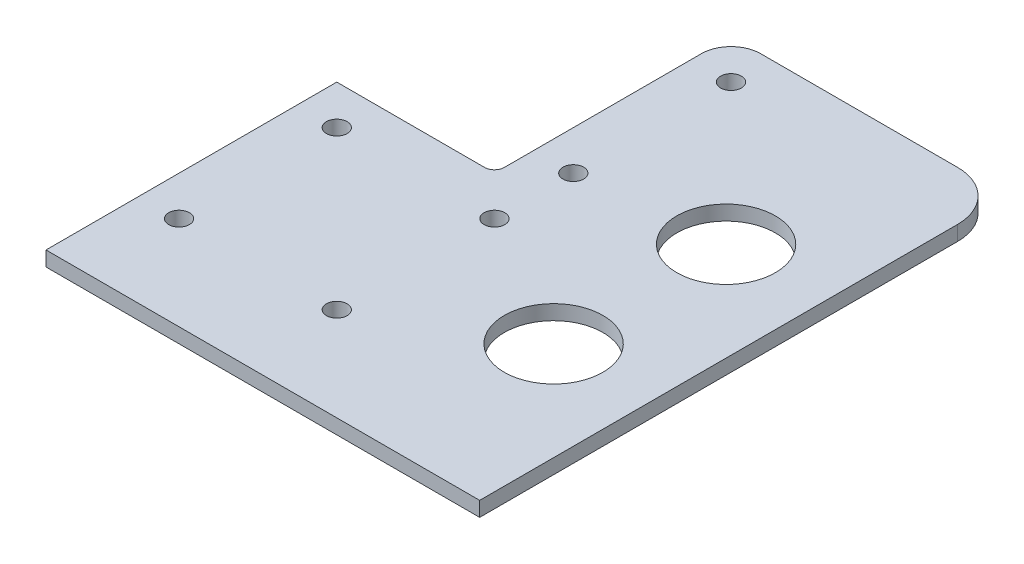
ISO-10303-21;
HEADER;
FILE_DESCRIPTION(('STEP AP214'),'2;1');
FILE_NAME('part.step','',(''),(''),'','','');
FILE_SCHEMA(('AUTOMOTIVE_DESIGN { 1 0 10303 214 1 1 1 1 }'));
ENDSEC;
DATA;
#1=APPLICATION_CONTEXT('core data for automotive mechanical design processes');
#2=APPLICATION_PROTOCOL_DEFINITION('international standard','automotive_design',2000,#1);
#3=PRODUCT_CONTEXT('',#1,'mechanical');
#4=PRODUCT('Part','Part','',(#3));
#5=PRODUCT_RELATED_PRODUCT_CATEGORY('part','',(#4));
#6=PRODUCT_DEFINITION_FORMATION('','',#4);
#7=PRODUCT_DEFINITION_CONTEXT('part definition',#1,'design');
#8=PRODUCT_DEFINITION('design','',#6,#7);
#9=PRODUCT_DEFINITION_SHAPE('','',#8);
#10=(LENGTH_UNIT() NAMED_UNIT(*) SI_UNIT(.MILLI.,.METRE.));
#11=(NAMED_UNIT(*) PLANE_ANGLE_UNIT() SI_UNIT($,.RADIAN.));
#12=(NAMED_UNIT(*) SI_UNIT($,.STERADIAN.) SOLID_ANGLE_UNIT());
#13=UNCERTAINTY_MEASURE_WITH_UNIT(LENGTH_MEASURE(1.E-05),#10,'distance_accuracy_value','');
#14=(GEOMETRIC_REPRESENTATION_CONTEXT(3) GLOBAL_UNCERTAINTY_ASSIGNED_CONTEXT((#13)) GLOBAL_UNIT_ASSIGNED_CONTEXT((#10,
#11,#12)) REPRESENTATION_CONTEXT('',''));
#15=CARTESIAN_POINT('',(0.,0.,0.));
#16=DIRECTION('',(0.,0.,1.));
#17=DIRECTION('',(1.,0.,0.));
#18=AXIS2_PLACEMENT_3D('',#15,#16,#17);
#19=CARTESIAN_POINT('',(58.,3.,-135.));
#20=DIRECTION('',(0.,-1.,0.));
#21=DIRECTION('',(0.,0.,-1.));
#22=AXIS2_PLACEMENT_3D('',#19,#20,#21);
#23=PLANE('',#22);
#24=DIRECTION('',(0.,0.,-1.));
#25=VECTOR('',#24,1.);
#26=CARTESIAN_POINT('',(-24.,3.,-24.));
#27=LINE('',#26,#25);
#28=CARTESIAN_POINT('',(-24.,3.,35.));
#29=VERTEX_POINT('',#28);
#30=CARTESIAN_POINT('',(-24.,3.,-24.));
#31=VERTEX_POINT('',#30);
#32=EDGE_CURVE('E173',#29,#31,#27,.T.);
#33=ORIENTED_EDGE('',*,*,#32,.F.);
#34=DIRECTION('',(1.,0.,0.));
#35=VECTOR('',#34,1.);
#36=CARTESIAN_POINT('',(58.,3.,35.));
#37=LINE('',#36,#35);
#38=CARTESIAN_POINT('',(64.,3.,35.));
#39=VERTEX_POINT('',#38);
#40=EDGE_CURVE('E120',#29,#39,#37,.T.);
#41=ORIENTED_EDGE('',*,*,#40,.T.);
#42=DIRECTION('',(0.,0.,1.));
#43=VECTOR('',#42,1.);
#44=CARTESIAN_POINT('',(64.,3.,43.));
#45=LINE('',#44,#43);
#46=CARTESIAN_POINT('',(64.,3.,-62.));
#47=VERTEX_POINT('',#46);
#48=EDGE_CURVE('E154',#47,#39,#45,.T.);
#49=ORIENTED_EDGE('',*,*,#48,.F.);
#50=CARTESIAN_POINT('',(54.,3.,-62.));
#51=DIRECTION('',(0.,-1.,0.));
#52=DIRECTION('',(0.,0.,-1.));
#53=AXIS2_PLACEMENT_3D('',#50,#51,#52);
#54=CIRCLE('',#53,10.);
#55=CARTESIAN_POINT('',(54.,3.,-72.));
#56=VERTEX_POINT('',#55);
#57=EDGE_CURVE('E192',#47,#56,#54,.F.);
#58=ORIENTED_EDGE('',*,*,#57,.T.);
#59=DIRECTION('',(1.,0.,0.));
#60=VECTOR('',#59,1.);
#61=CARTESIAN_POINT('',(14.,3.,-72.));
#62=LINE('',#61,#60);
#63=CARTESIAN_POINT('',(14.,3.,-72.));
#64=VERTEX_POINT('',#63);
#65=EDGE_CURVE('E198',#64,#56,#62,.T.);
#66=ORIENTED_EDGE('',*,*,#65,.F.);
#67=CARTESIAN_POINT('',(14.,3.,-66.));
#68=DIRECTION('',(0.,-1.,0.));
#69=DIRECTION('',(0.,0.,1.));
#70=AXIS2_PLACEMENT_3D('',#67,#68,#69);
#71=CIRCLE('',#70,6.);
#72=CARTESIAN_POINT('',(8.,3.,-66.));
#73=VERTEX_POINT('',#72);
#74=EDGE_CURVE('E200',#73,#64,#71,.T.);
#75=ORIENTED_EDGE('',*,*,#74,.F.);
#76=DIRECTION('',(0.,0.,-1.));
#77=VECTOR('',#76,1.);
#78=CARTESIAN_POINT('',(8.,3.,-26.));
#79=LINE('',#78,#77);
#80=CARTESIAN_POINT('',(8.,3.,-26.));
#81=VERTEX_POINT('',#80);
#82=EDGE_CURVE('E203',#81,#73,#79,.T.);
#83=ORIENTED_EDGE('',*,*,#82,.F.);
#84=CARTESIAN_POINT('',(6.,3.,-26.));
#85=DIRECTION('',(0.,1.,0.));
#86=DIRECTION('',(0.,0.,1.));
#87=AXIS2_PLACEMENT_3D('',#84,#85,#86);
#88=CIRCLE('',#87,2.);
#89=CARTESIAN_POINT('',(6.,3.,-24.));
#90=VERTEX_POINT('',#89);
#91=EDGE_CURVE('E207',#90,#81,#88,.T.);
#92=ORIENTED_EDGE('',*,*,#91,.F.);
#93=DIRECTION('',(1.,0.,0.));
#94=VECTOR('',#93,1.);
#95=CARTESIAN_POINT('',(5.99999999999999,3.,-24.));
#96=LINE('',#95,#94);
#97=EDGE_CURVE('E211',#31,#90,#96,.T.);
#98=ORIENTED_EDGE('',*,*,#97,.F.);
#99=EDGE_LOOP('',(#33,#41,#49,#58,#66,#75,#83,#92,#98));
#100=FACE_BOUND('',#99,.T.);
#101=CARTESIAN_POINT('',(-16.,3.,-16.));
#102=DIRECTION('',(0.,-1.,0.));
#103=DIRECTION('',(0.,0.,1.));
#104=AXIS2_PLACEMENT_3D('',#101,#102,#103);
#105=CIRCLE('',#104,2.1);
#106=CARTESIAN_POINT('',(-16.,3.,-13.9));
#107=VERTEX_POINT('',#106);
#108=EDGE_CURVE('E144',#107,#107,#105,.T.);
#109=ORIENTED_EDGE('',*,*,#108,.T.);
#110=EDGE_LOOP('',(#109));
#111=FACE_BOUND('',#110,.T.);
#112=CARTESIAN_POINT('',(-16.,3.,16.));
#113=DIRECTION('',(0.,-1.,0.));
#114=DIRECTION('',(0.,0.,1.));
#115=AXIS2_PLACEMENT_3D('',#112,#113,#114);
#116=CIRCLE('',#115,2.1);
#117=CARTESIAN_POINT('',(-16.,3.,18.1));
#118=VERTEX_POINT('',#117);
#119=EDGE_CURVE('E220',#118,#118,#116,.T.);
#120=ORIENTED_EDGE('',*,*,#119,.T.);
#121=EDGE_LOOP('',(#120));
#122=FACE_BOUND('',#121,.T.);
#123=CARTESIAN_POINT('',(16.,3.,16.));
#124=DIRECTION('',(0.,-1.,0.));
#125=DIRECTION('',(0.,0.,1.));
#126=AXIS2_PLACEMENT_3D('',#123,#124,#125);
#127=CIRCLE('',#126,2.1);
#128=CARTESIAN_POINT('',(16.,3.,18.1));
#129=VERTEX_POINT('',#128);
#130=EDGE_CURVE('E226',#129,#129,#127,.T.);
#131=ORIENTED_EDGE('',*,*,#130,.T.);
#132=EDGE_LOOP('',(#131));
#133=FACE_BOUND('',#132,.T.);
#134=CARTESIAN_POINT('',(16.,3.,-16.));
#135=DIRECTION('',(0.,-1.,0.));
#136=DIRECTION('',(0.,0.,1.));
#137=AXIS2_PLACEMENT_3D('',#134,#135,#136);
#138=CIRCLE('',#137,2.1);
#139=CARTESIAN_POINT('',(16.,3.,-13.9));
#140=VERTEX_POINT('',#139);
#141=EDGE_CURVE('E234',#140,#140,#138,.T.);
#142=ORIENTED_EDGE('',*,*,#141,.T.);
#143=EDGE_LOOP('',(#142));
#144=FACE_BOUND('',#143,.T.);
#145=CARTESIAN_POINT('',(16.0000000000001,3.,-32.));
#146=DIRECTION('',(0.,-1.,0.));
#147=DIRECTION('',(0.,0.,1.));
#148=AXIS2_PLACEMENT_3D('',#145,#146,#147);
#149=CIRCLE('',#148,2.1);
#150=CARTESIAN_POINT('',(16.0000000000001,3.,-29.9));
#151=VERTEX_POINT('',#150);
#152=EDGE_CURVE('E242',#151,#151,#149,.T.);
#153=ORIENTED_EDGE('',*,*,#152,.T.);
#154=EDGE_LOOP('',(#153));
#155=FACE_BOUND('',#154,.T.);
#156=CARTESIAN_POINT('',(16.0000000000002,3.,-64.));
#157=DIRECTION('',(0.,-1.,0.));
#158=DIRECTION('',(0.,0.,1.));
#159=AXIS2_PLACEMENT_3D('',#156,#157,#158);
#160=CIRCLE('',#159,2.1);
#161=CARTESIAN_POINT('',(16.0000000000002,3.,-61.9));
#162=VERTEX_POINT('',#161);
#163=EDGE_CURVE('E250',#162,#162,#160,.T.);
#164=ORIENTED_EDGE('',*,*,#163,.T.);
#165=EDGE_LOOP('',(#164));
#166=FACE_BOUND('',#165,.T.);
#167=CARTESIAN_POINT('',(44.,3.,0.));
#168=DIRECTION('',(0.,-1.,0.));
#169=DIRECTION('',(0.,0.,1.));
#170=AXIS2_PLACEMENT_3D('',#167,#168,#169);
#171=CIRCLE('',#170,10.);
#172=CARTESIAN_POINT('',(44.,3.,10.));
#173=VERTEX_POINT('',#172);
#174=EDGE_CURVE('E258',#173,#173,#171,.T.);
#175=ORIENTED_EDGE('',*,*,#174,.T.);
#176=EDGE_LOOP('',(#175));
#177=FACE_BOUND('',#176,.T.);
#178=CARTESIAN_POINT('',(44.0000000000001,3.,-35.));
#179=DIRECTION('',(0.,-1.,0.));
#180=DIRECTION('',(0.,0.,1.));
#181=AXIS2_PLACEMENT_3D('',#178,#179,#180);
#182=CIRCLE('',#181,10.);
#183=CARTESIAN_POINT('',(44.0000000000001,3.,-25.));
#184=VERTEX_POINT('',#183);
#185=EDGE_CURVE('E266',#184,#184,#182,.T.);
#186=ORIENTED_EDGE('',*,*,#185,.T.);
#187=EDGE_LOOP('',(#186));
#188=FACE_BOUND('',#187,.T.);
#189=ADVANCED_FACE('F47',(#100,#111,#122,#133,#144,#155,#166,#177,#188),#23,.F.);
#190=CARTESIAN_POINT('',(58.,0.,-135.));
#191=DIRECTION('',(0.,-1.,0.));
#192=DIRECTION('',(0.,0.,-1.));
#193=AXIS2_PLACEMENT_3D('',#190,#191,#192);
#194=PLANE('',#193);
#195=DIRECTION('',(-1.,0.,0.));
#196=VECTOR('',#195,1.);
#197=CARTESIAN_POINT('',(-24.,0.,35.));
#198=LINE('',#197,#196);
#199=CARTESIAN_POINT('',(64.,0.,35.));
#200=VERTEX_POINT('',#199);
#201=CARTESIAN_POINT('',(-24.,0.,35.));
#202=VERTEX_POINT('',#201);
#203=EDGE_CURVE('E63',#200,#202,#198,.T.);
#204=ORIENTED_EDGE('',*,*,#203,.T.);
#205=DIRECTION('',(0.,0.,-1.));
#206=VECTOR('',#205,1.);
#207=CARTESIAN_POINT('',(-24.,0.,-24.));
#208=LINE('',#207,#206);
#209=CARTESIAN_POINT('',(-24.,0.,-24.));
#210=VERTEX_POINT('',#209);
#211=EDGE_CURVE('E132',#202,#210,#208,.T.);
#212=ORIENTED_EDGE('',*,*,#211,.T.);
#213=DIRECTION('',(1.,0.,0.));
#214=VECTOR('',#213,1.);
#215=CARTESIAN_POINT('',(5.99999999999999,0.,-24.));
#216=LINE('',#215,#214);
#217=CARTESIAN_POINT('',(6.,0.,-24.));
#218=VERTEX_POINT('',#217);
#219=EDGE_CURVE('E143',#210,#218,#216,.T.);
#220=ORIENTED_EDGE('',*,*,#219,.T.);
#221=CARTESIAN_POINT('',(6.,0.,-26.));
#222=DIRECTION('',(0.,1.,0.));
#223=DIRECTION('',(0.,0.,1.));
#224=AXIS2_PLACEMENT_3D('',#221,#222,#223);
#225=CIRCLE('',#224,2.);
#226=CARTESIAN_POINT('',(8.,0.,-26.));
#227=VERTEX_POINT('',#226);
#228=EDGE_CURVE('E148',#218,#227,#225,.T.);
#229=ORIENTED_EDGE('',*,*,#228,.T.);
#230=DIRECTION('',(0.,0.,-1.));
#231=VECTOR('',#230,1.);
#232=CARTESIAN_POINT('',(8.,0.,-26.));
#233=LINE('',#232,#231);
#234=CARTESIAN_POINT('',(8.,0.,-66.));
#235=VERTEX_POINT('',#234);
#236=EDGE_CURVE('E160',#227,#235,#233,.T.);
#237=ORIENTED_EDGE('',*,*,#236,.T.);
#238=CARTESIAN_POINT('',(14.,0.,-66.));
#239=DIRECTION('',(0.,-1.,0.));
#240=DIRECTION('',(0.,0.,1.));
#241=AXIS2_PLACEMENT_3D('',#238,#239,#240);
#242=CIRCLE('',#241,6.);
#243=CARTESIAN_POINT('',(14.,0.,-72.));
#244=VERTEX_POINT('',#243);
#245=EDGE_CURVE('E164',#235,#244,#242,.T.);
#246=ORIENTED_EDGE('',*,*,#245,.T.);
#247=DIRECTION('',(1.,0.,0.));
#248=VECTOR('',#247,1.);
#249=CARTESIAN_POINT('',(14.,0.,-72.));
#250=LINE('',#249,#248);
#251=CARTESIAN_POINT('',(54.,0.,-72.));
#252=VERTEX_POINT('',#251);
#253=EDGE_CURVE('E168',#244,#252,#250,.T.);
#254=ORIENTED_EDGE('',*,*,#253,.T.);
#255=CARTESIAN_POINT('',(54.,0.,-62.));
#256=DIRECTION('',(0.,-1.,0.));
#257=DIRECTION('',(0.,0.,-1.));
#258=AXIS2_PLACEMENT_3D('',#255,#256,#257);
#259=CIRCLE('',#258,10.);
#260=CARTESIAN_POINT('',(64.,0.,-62.));
#261=VERTEX_POINT('',#260);
#262=EDGE_CURVE('E11',#252,#261,#259,.T.);
#263=ORIENTED_EDGE('',*,*,#262,.T.);
#264=DIRECTION('',(0.,0.,1.));
#265=VECTOR('',#264,1.);
#266=CARTESIAN_POINT('',(64.,0.,43.));
#267=LINE('',#266,#265);
#268=EDGE_CURVE('E135',#261,#200,#267,.T.);
#269=ORIENTED_EDGE('',*,*,#268,.T.);
#270=EDGE_LOOP('',(#204,#212,#220,#229,#237,#246,#254,#263,#269));
#271=FACE_BOUND('',#270,.T.);
#272=CARTESIAN_POINT('',(44.,0.,0.));
#273=DIRECTION('',(0.,-1.,0.));
#274=DIRECTION('',(0.,0.,1.));
#275=AXIS2_PLACEMENT_3D('',#272,#273,#274);
#276=CIRCLE('',#275,10.);
#277=CARTESIAN_POINT('',(44.,0.,10.));
#278=VERTEX_POINT('',#277);
#279=EDGE_CURVE('E262',#278,#278,#276,.T.);
#280=ORIENTED_EDGE('',*,*,#279,.F.);
#281=EDGE_LOOP('',(#280));
#282=FACE_BOUND('',#281,.T.);
#283=CARTESIAN_POINT('',(16.0000000000001,0.,-32.));
#284=DIRECTION('',(0.,-1.,0.));
#285=DIRECTION('',(0.,0.,1.));
#286=AXIS2_PLACEMENT_3D('',#283,#284,#285);
#287=CIRCLE('',#286,2.1);
#288=CARTESIAN_POINT('',(16.0000000000001,0.,-29.9));
#289=VERTEX_POINT('',#288);
#290=EDGE_CURVE('E246',#289,#289,#287,.T.);
#291=ORIENTED_EDGE('',*,*,#290,.F.);
#292=EDGE_LOOP('',(#291));
#293=FACE_BOUND('',#292,.T.);
#294=CARTESIAN_POINT('',(16.,0.,16.));
#295=DIRECTION('',(0.,-1.,0.));
#296=DIRECTION('',(0.,0.,1.));
#297=AXIS2_PLACEMENT_3D('',#294,#295,#296);
#298=CIRCLE('',#297,2.1);
#299=CARTESIAN_POINT('',(16.,0.,18.1));
#300=VERTEX_POINT('',#299);
#301=EDGE_CURVE('E230',#300,#300,#298,.T.);
#302=ORIENTED_EDGE('',*,*,#301,.F.);
#303=EDGE_LOOP('',(#302));
#304=FACE_BOUND('',#303,.T.);
#305=CARTESIAN_POINT('',(-16.,0.,-16.));
#306=DIRECTION('',(0.,-1.,0.));
#307=DIRECTION('',(0.,0.,1.));
#308=AXIS2_PLACEMENT_3D('',#305,#306,#307);
#309=CIRCLE('',#308,2.1);
#310=CARTESIAN_POINT('',(-16.,0.,-13.9));
#311=VERTEX_POINT('',#310);
#312=EDGE_CURVE('E151',#311,#311,#309,.T.);
#313=ORIENTED_EDGE('',*,*,#312,.F.);
#314=EDGE_LOOP('',(#313));
#315=FACE_BOUND('',#314,.T.);
#316=CARTESIAN_POINT('',(-16.,0.,16.));
#317=DIRECTION('',(0.,-1.,0.));
#318=DIRECTION('',(0.,0.,1.));
#319=AXIS2_PLACEMENT_3D('',#316,#317,#318);
#320=CIRCLE('',#319,2.1);
#321=CARTESIAN_POINT('',(-16.,0.,18.1));
#322=VERTEX_POINT('',#321);
#323=EDGE_CURVE('E222',#322,#322,#320,.T.);
#324=ORIENTED_EDGE('',*,*,#323,.F.);
#325=EDGE_LOOP('',(#324));
#326=FACE_BOUND('',#325,.T.);
#327=CARTESIAN_POINT('',(16.,0.,-16.));
#328=DIRECTION('',(0.,-1.,0.));
#329=DIRECTION('',(0.,0.,1.));
#330=AXIS2_PLACEMENT_3D('',#327,#328,#329);
#331=CIRCLE('',#330,2.1);
#332=CARTESIAN_POINT('',(16.,0.,-13.9));
#333=VERTEX_POINT('',#332);
#334=EDGE_CURVE('E238',#333,#333,#331,.T.);
#335=ORIENTED_EDGE('',*,*,#334,.F.);
#336=EDGE_LOOP('',(#335));
#337=FACE_BOUND('',#336,.T.);
#338=CARTESIAN_POINT('',(16.0000000000002,0.,-64.));
#339=DIRECTION('',(0.,-1.,0.));
#340=DIRECTION('',(0.,0.,1.));
#341=AXIS2_PLACEMENT_3D('',#338,#339,#340);
#342=CIRCLE('',#341,2.1);
#343=CARTESIAN_POINT('',(16.0000000000002,0.,-61.9));
#344=VERTEX_POINT('',#343);
#345=EDGE_CURVE('E254',#344,#344,#342,.T.);
#346=ORIENTED_EDGE('',*,*,#345,.F.);
#347=EDGE_LOOP('',(#346));
#348=FACE_BOUND('',#347,.T.);
#349=CARTESIAN_POINT('',(44.0000000000001,0.,-35.));
#350=DIRECTION('',(0.,-1.,0.));
#351=DIRECTION('',(0.,0.,1.));
#352=AXIS2_PLACEMENT_3D('',#349,#350,#351);
#353=CIRCLE('',#352,10.);
#354=CARTESIAN_POINT('',(44.0000000000001,0.,-25.));
#355=VERTEX_POINT('',#354);
#356=EDGE_CURVE('E270',#355,#355,#353,.T.);
#357=ORIENTED_EDGE('',*,*,#356,.F.);
#358=EDGE_LOOP('',(#357));
#359=FACE_BOUND('',#358,.T.);
#360=ADVANCED_FACE('F129',(#271,#282,#293,#304,#315,#326,#337,#348,#359),#194,.T.);
#361=CARTESIAN_POINT('',(-24.,3.,-24.));
#362=DIRECTION('',(1.,0.,0.));
#363=DIRECTION('',(0.,0.,1.));
#364=AXIS2_PLACEMENT_3D('',#361,#362,#363);
#365=PLANE('',#364);
#366=ORIENTED_EDGE('',*,*,#211,.F.);
#367=DIRECTION('',(0.,1.,0.));
#368=VECTOR('',#367,1.);
#369=CARTESIAN_POINT('',(-24.,0.,35.));
#370=LINE('',#369,#368);
#371=EDGE_CURVE('E117',#202,#29,#370,.T.);
#372=ORIENTED_EDGE('',*,*,#371,.T.);
#373=ORIENTED_EDGE('',*,*,#32,.T.);
#374=DIRECTION('',(0.,-1.,0.));
#375=VECTOR('',#374,1.);
#376=CARTESIAN_POINT('',(-24.,3.,-24.));
#377=LINE('',#376,#375);
#378=EDGE_CURVE('E140',#31,#210,#377,.T.);
#379=ORIENTED_EDGE('',*,*,#378,.T.);
#380=EDGE_LOOP('',(#366,#372,#373,#379));
#381=FACE_BOUND('',#380,.T.);
#382=ADVANCED_FACE('F138',(#381),#365,.F.);
#383=CARTESIAN_POINT('',(5.99999999999999,3.,-24.));
#384=DIRECTION('',(0.,0.,1.));
#385=DIRECTION('',(-1.,0.,0.));
#386=AXIS2_PLACEMENT_3D('',#383,#384,#385);
#387=PLANE('',#386);
#388=ORIENTED_EDGE('',*,*,#219,.F.);
#389=ORIENTED_EDGE('',*,*,#378,.F.);
#390=ORIENTED_EDGE('',*,*,#97,.T.);
#391=DIRECTION('',(0.,-1.,0.));
#392=VECTOR('',#391,1.);
#393=CARTESIAN_POINT('',(6.,3.,-24.));
#394=LINE('',#393,#392);
#395=EDGE_CURVE('E183',#90,#218,#394,.T.);
#396=ORIENTED_EDGE('',*,*,#395,.T.);
#397=EDGE_LOOP('',(#388,#389,#390,#396));
#398=FACE_BOUND('',#397,.T.);
#399=ADVANCED_FACE('F304',(#398),#387,.F.);
#400=CARTESIAN_POINT('',(6.,3.,-26.));
#401=DIRECTION('',(0.,-1.,0.));
#402=DIRECTION('',(0.,0.,-1.));
#403=AXIS2_PLACEMENT_3D('',#400,#401,#402);
#404=CYLINDRICAL_SURFACE('',#403,2.);
#405=ORIENTED_EDGE('',*,*,#228,.F.);
#406=ORIENTED_EDGE('',*,*,#395,.F.);
#407=ORIENTED_EDGE('',*,*,#91,.T.);
#408=DIRECTION('',(0.,-1.,0.));
#409=VECTOR('',#408,1.);
#410=CARTESIAN_POINT('',(8.,3.,-26.));
#411=LINE('',#410,#409);
#412=EDGE_CURVE('E180',#81,#227,#411,.T.);
#413=ORIENTED_EDGE('',*,*,#412,.T.);
#414=EDGE_LOOP('',(#405,#406,#407,#413));
#415=FACE_BOUND('',#414,.T.);
#416=ADVANCED_FACE('F302',(#415),#404,.F.);
#417=CARTESIAN_POINT('',(8.,3.,-26.));
#418=DIRECTION('',(1.,0.,0.));
#419=DIRECTION('',(0.,0.,1.));
#420=AXIS2_PLACEMENT_3D('',#417,#418,#419);
#421=PLANE('',#420);
#422=ORIENTED_EDGE('',*,*,#236,.F.);
#423=ORIENTED_EDGE('',*,*,#412,.F.);
#424=ORIENTED_EDGE('',*,*,#82,.T.);
#425=DIRECTION('',(0.,-1.,0.));
#426=VECTOR('',#425,1.);
#427=CARTESIAN_POINT('',(8.,3.,-66.));
#428=LINE('',#427,#426);
#429=EDGE_CURVE('E177',#73,#235,#428,.T.);
#430=ORIENTED_EDGE('',*,*,#429,.T.);
#431=EDGE_LOOP('',(#422,#423,#424,#430));
#432=FACE_BOUND('',#431,.T.);
#433=ADVANCED_FACE('F299',(#432),#421,.F.);
#434=CARTESIAN_POINT('',(14.,3.,-66.));
#435=DIRECTION('',(0.,-1.,0.));
#436=DIRECTION('',(0.,0.,-1.));
#437=AXIS2_PLACEMENT_3D('',#434,#435,#436);
#438=CYLINDRICAL_SURFACE('',#437,6.);
#439=ORIENTED_EDGE('',*,*,#245,.F.);
#440=ORIENTED_EDGE('',*,*,#429,.F.);
#441=ORIENTED_EDGE('',*,*,#74,.T.);
#442=DIRECTION('',(0.,-1.,0.));
#443=VECTOR('',#442,1.);
#444=CARTESIAN_POINT('',(14.,3.,-72.));
#445=LINE('',#444,#443);
#446=EDGE_CURVE('E174',#64,#244,#445,.T.);
#447=ORIENTED_EDGE('',*,*,#446,.T.);
#448=EDGE_LOOP('',(#439,#440,#441,#447));
#449=FACE_BOUND('',#448,.T.);
#450=ADVANCED_FACE('F294',(#449),#438,.T.);
#451=CARTESIAN_POINT('',(14.,3.,-72.));
#452=DIRECTION('',(0.,0.,1.));
#453=DIRECTION('',(-1.,0.,0.));
#454=AXIS2_PLACEMENT_3D('',#451,#452,#453);
#455=PLANE('',#454);
#456=ORIENTED_EDGE('',*,*,#65,.T.);
#457=DIRECTION('',(0.,1.,0.));
#458=VECTOR('',#457,1.);
#459=CARTESIAN_POINT('',(54.,3.,-72.));
#460=LINE('',#459,#458);
#461=EDGE_CURVE('E56',#56,#252,#460,.F.);
#462=ORIENTED_EDGE('',*,*,#461,.T.);
#463=ORIENTED_EDGE('',*,*,#253,.F.);
#464=ORIENTED_EDGE('',*,*,#446,.F.);
#465=EDGE_LOOP('',(#456,#462,#463,#464));
#466=FACE_BOUND('',#465,.T.);
#467=ADVANCED_FACE('F291',(#466),#455,.F.);
#468=CARTESIAN_POINT('',(64.,3.,43.));
#469=DIRECTION('',(-1.,0.,0.));
#470=DIRECTION('',(0.,0.,-1.));
#471=AXIS2_PLACEMENT_3D('',#468,#469,#470);
#472=PLANE('',#471);
#473=ORIENTED_EDGE('',*,*,#48,.T.);
#474=DIRECTION('',(0.,1.,0.));
#475=VECTOR('',#474,1.);
#476=CARTESIAN_POINT('',(64.,0.,35.));
#477=LINE('',#476,#475);
#478=EDGE_CURVE('E125',#200,#39,#477,.T.);
#479=ORIENTED_EDGE('',*,*,#478,.F.);
#480=ORIENTED_EDGE('',*,*,#268,.F.);
#481=DIRECTION('',(0.,1.,0.));
#482=VECTOR('',#481,1.);
#483=CARTESIAN_POINT('',(64.,3.,-62.));
#484=LINE('',#483,#482);
#485=EDGE_CURVE('E188',#261,#47,#484,.T.);
#486=ORIENTED_EDGE('',*,*,#485,.T.);
#487=EDGE_LOOP('',(#473,#479,#480,#486));
#488=FACE_BOUND('',#487,.T.);
#489=ADVANCED_FACE('F285',(#488),#472,.F.);
#490=CARTESIAN_POINT('',(-16.,3.,-16.));
#491=DIRECTION('',(0.,-1.,0.));
#492=DIRECTION('',(0.,0.,-1.));
#493=AXIS2_PLACEMENT_3D('',#490,#491,#492);
#494=CYLINDRICAL_SURFACE('',#493,2.1);
#495=ORIENTED_EDGE('',*,*,#108,.F.);
#496=EDGE_LOOP('',(#495));
#497=FACE_BOUND('',#496,.T.);
#498=ORIENTED_EDGE('',*,*,#312,.T.);
#499=EDGE_LOOP('',(#498));
#500=FACE_BOUND('',#499,.T.);
#501=ADVANCED_FACE('F320',(#497,#500),#494,.F.);
#502=CARTESIAN_POINT('',(-16.,3.,16.));
#503=DIRECTION('',(0.,-1.,0.));
#504=DIRECTION('',(0.,0.,-1.));
#505=AXIS2_PLACEMENT_3D('',#502,#503,#504);
#506=CYLINDRICAL_SURFACE('',#505,2.1);
#507=ORIENTED_EDGE('',*,*,#119,.F.);
#508=EDGE_LOOP('',(#507));
#509=FACE_BOUND('',#508,.T.);
#510=ORIENTED_EDGE('',*,*,#323,.T.);
#511=EDGE_LOOP('',(#510));
#512=FACE_BOUND('',#511,.T.);
#513=ADVANCED_FACE('F347',(#509,#512),#506,.F.);
#514=CARTESIAN_POINT('',(16.,3.,16.));
#515=DIRECTION('',(0.,-1.,0.));
#516=DIRECTION('',(0.,0.,-1.));
#517=AXIS2_PLACEMENT_3D('',#514,#515,#516);
#518=CYLINDRICAL_SURFACE('',#517,2.1);
#519=ORIENTED_EDGE('',*,*,#130,.F.);
#520=EDGE_LOOP('',(#519));
#521=FACE_BOUND('',#520,.T.);
#522=ORIENTED_EDGE('',*,*,#301,.T.);
#523=EDGE_LOOP('',(#522));
#524=FACE_BOUND('',#523,.T.);
#525=ADVANCED_FACE('F356',(#521,#524),#518,.F.);
#526=CARTESIAN_POINT('',(16.,3.,-16.));
#527=DIRECTION('',(0.,-1.,0.));
#528=DIRECTION('',(0.,0.,-1.));
#529=AXIS2_PLACEMENT_3D('',#526,#527,#528);
#530=CYLINDRICAL_SURFACE('',#529,2.1);
#531=ORIENTED_EDGE('',*,*,#141,.F.);
#532=EDGE_LOOP('',(#531));
#533=FACE_BOUND('',#532,.T.);
#534=ORIENTED_EDGE('',*,*,#334,.T.);
#535=EDGE_LOOP('',(#534));
#536=FACE_BOUND('',#535,.T.);
#537=ADVANCED_FACE('F364',(#533,#536),#530,.F.);
#538=CARTESIAN_POINT('',(16.0000000000001,3.,-32.));
#539=DIRECTION('',(0.,-1.,0.));
#540=DIRECTION('',(0.,0.,-1.));
#541=AXIS2_PLACEMENT_3D('',#538,#539,#540);
#542=CYLINDRICAL_SURFACE('',#541,2.1);
#543=ORIENTED_EDGE('',*,*,#152,.F.);
#544=EDGE_LOOP('',(#543));
#545=FACE_BOUND('',#544,.T.);
#546=ORIENTED_EDGE('',*,*,#290,.T.);
#547=EDGE_LOOP('',(#546));
#548=FACE_BOUND('',#547,.T.);
#549=ADVANCED_FACE('F373',(#545,#548),#542,.F.);
#550=CARTESIAN_POINT('',(16.0000000000002,3.,-64.));
#551=DIRECTION('',(0.,-1.,0.));
#552=DIRECTION('',(0.,0.,-1.));
#553=AXIS2_PLACEMENT_3D('',#550,#551,#552);
#554=CYLINDRICAL_SURFACE('',#553,2.1);
#555=ORIENTED_EDGE('',*,*,#163,.F.);
#556=EDGE_LOOP('',(#555));
#557=FACE_BOUND('',#556,.T.);
#558=ORIENTED_EDGE('',*,*,#345,.T.);
#559=EDGE_LOOP('',(#558));
#560=FACE_BOUND('',#559,.T.);
#561=ADVANCED_FACE('F382',(#557,#560),#554,.F.);
#562=CARTESIAN_POINT('',(44.,3.,0.));
#563=DIRECTION('',(0.,-1.,0.));
#564=DIRECTION('',(0.,0.,-1.));
#565=AXIS2_PLACEMENT_3D('',#562,#563,#564);
#566=CYLINDRICAL_SURFACE('',#565,10.);
#567=ORIENTED_EDGE('',*,*,#174,.F.);
#568=EDGE_LOOP('',(#567));
#569=FACE_BOUND('',#568,.T.);
#570=ORIENTED_EDGE('',*,*,#279,.T.);
#571=EDGE_LOOP('',(#570));
#572=FACE_BOUND('',#571,.T.);
#573=ADVANCED_FACE('F391',(#569,#572),#566,.F.);
#574=CARTESIAN_POINT('',(44.0000000000001,3.,-35.));
#575=DIRECTION('',(0.,-1.,0.));
#576=DIRECTION('',(0.,0.,-1.));
#577=AXIS2_PLACEMENT_3D('',#574,#575,#576);
#578=CYLINDRICAL_SURFACE('',#577,10.);
#579=ORIENTED_EDGE('',*,*,#185,.F.);
#580=EDGE_LOOP('',(#579));
#581=FACE_BOUND('',#580,.T.);
#582=ORIENTED_EDGE('',*,*,#356,.T.);
#583=EDGE_LOOP('',(#582));
#584=FACE_BOUND('',#583,.T.);
#585=ADVANCED_FACE('F400',(#581,#584),#578,.F.);
#586=CARTESIAN_POINT('',(54.,3.,-62.));
#587=DIRECTION('',(0.,1.,0.));
#588=DIRECTION('',(0.,0.,1.));
#589=AXIS2_PLACEMENT_3D('',#586,#587,#588);
#590=CYLINDRICAL_SURFACE('',#589,10.);
#591=ORIENTED_EDGE('',*,*,#262,.F.);
#592=ORIENTED_EDGE('',*,*,#461,.F.);
#593=ORIENTED_EDGE('',*,*,#57,.F.);
#594=ORIENTED_EDGE('',*,*,#485,.F.);
#595=EDGE_LOOP('',(#591,#592,#593,#594));
#596=FACE_BOUND('',#595,.T.);
#597=ADVANCED_FACE('F49',(#596),#590,.T.);
#598=CARTESIAN_POINT('',(-24.,0.,35.));
#599=DIRECTION('',(0.,0.,-1.));
#600=DIRECTION('',(-1.,0.,0.));
#601=AXIS2_PLACEMENT_3D('',#598,#599,#600);
#602=PLANE('',#601);
#603=ORIENTED_EDGE('',*,*,#371,.F.);
#604=ORIENTED_EDGE('',*,*,#203,.F.);
#605=ORIENTED_EDGE('',*,*,#478,.T.);
#606=ORIENTED_EDGE('',*,*,#40,.F.);
#607=EDGE_LOOP('',(#603,#604,#605,#606));
#608=FACE_BOUND('',#607,.T.);
#609=ADVANCED_FACE('F118',(#608),#602,.F.);
#610=CLOSED_SHELL('',(#189,#360,#382,#399,#416,#433,#450,#467,#489,#501,#513,#525,#537,#549,
#561,#573,#585,#597,#609));
#611=MANIFOLD_SOLID_BREP('B2',#610);
#612=ADVANCED_BREP_SHAPE_REPRESENTATION('',(#18,#611),#14);
#613=SHAPE_DEFINITION_REPRESENTATION(#9,#612);
ENDSEC;
END-ISO-10303-21;
